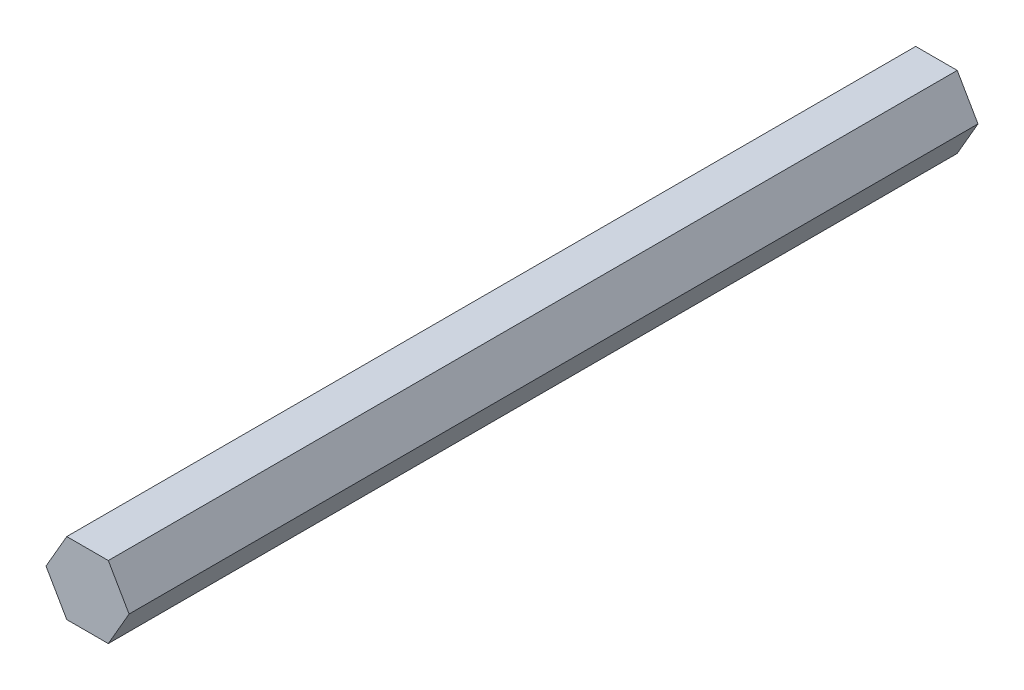
ISO-10303-21;
HEADER;
FILE_DESCRIPTION(('STEP AP214'),'2;1');
FILE_NAME('part.step','',(''),(''),'','','');
FILE_SCHEMA(('AUTOMOTIVE_DESIGN { 1 0 10303 214 1 1 1 1 }'));
ENDSEC;
DATA;
#1=APPLICATION_CONTEXT('core data for automotive mechanical design processes');
#2=APPLICATION_PROTOCOL_DEFINITION('international standard','automotive_design',2000,#1);
#3=PRODUCT_CONTEXT('',#1,'mechanical');
#4=PRODUCT('Part','Part','',(#3));
#5=PRODUCT_RELATED_PRODUCT_CATEGORY('part','',(#4));
#6=PRODUCT_DEFINITION_FORMATION('','',#4);
#7=PRODUCT_DEFINITION_CONTEXT('part definition',#1,'design');
#8=PRODUCT_DEFINITION('design','',#6,#7);
#9=PRODUCT_DEFINITION_SHAPE('','',#8);
#10=(LENGTH_UNIT() NAMED_UNIT(*) SI_UNIT(.MILLI.,.METRE.));
#11=(NAMED_UNIT(*) PLANE_ANGLE_UNIT() SI_UNIT($,.RADIAN.));
#12=(NAMED_UNIT(*) SI_UNIT($,.STERADIAN.) SOLID_ANGLE_UNIT());
#13=UNCERTAINTY_MEASURE_WITH_UNIT(LENGTH_MEASURE(1.E-05),#10,'distance_accuracy_value','');
#14=(GEOMETRIC_REPRESENTATION_CONTEXT(3) GLOBAL_UNCERTAINTY_ASSIGNED_CONTEXT((#13)) GLOBAL_UNIT_ASSIGNED_CONTEXT((#10,
#11,#12)) REPRESENTATION_CONTEXT('',''));
#15=CARTESIAN_POINT('',(0.,0.,0.));
#16=DIRECTION('',(0.,0.,1.));
#17=DIRECTION('',(1.,0.,0.));
#18=AXIS2_PLACEMENT_3D('',#15,#16,#17);
#19=CARTESIAN_POINT('',(3.66617420935418,-6.34999999999993,149.86));
#20=DIRECTION('',(-0.866025403784442,0.499999999999995,0.));
#21=DIRECTION('',(-0.499999999999995,-0.866025403784442,0.));
#22=AXIS2_PLACEMENT_3D('',#19,#20,#21);
#23=PLANE('',#22);
#24=DIRECTION('',(0.499999999999995,0.866025403784441,0.));
#25=VECTOR('',#24,1.);
#26=CARTESIAN_POINT('',(3.66617420935418,-6.34999999999993,0.));
#27=LINE('',#26,#25);
#28=CARTESIAN_POINT('',(3.66617420935418,-6.34999999999993,0.));
#29=VERTEX_POINT('',#28);
#30=CARTESIAN_POINT('',(7.33234841870822,0.,0.));
#31=VERTEX_POINT('',#30);
#32=EDGE_CURVE('E118',#29,#31,#27,.T.);
#33=ORIENTED_EDGE('',*,*,#32,.T.);
#34=DIRECTION('',(0.,0.,-1.));
#35=VECTOR('',#34,1.);
#36=CARTESIAN_POINT('',(7.33234841870822,0.,149.86));
#37=LINE('',#36,#35);
#38=CARTESIAN_POINT('',(7.33234841870822,0.,149.86));
#39=VERTEX_POINT('',#38);
#40=EDGE_CURVE('E11',#39,#31,#37,.T.);
#41=ORIENTED_EDGE('',*,*,#40,.F.);
#42=DIRECTION('',(0.499999999999995,0.866025403784441,0.));
#43=VECTOR('',#42,1.);
#44=CARTESIAN_POINT('',(3.66617420935418,-6.34999999999993,149.86));
#45=LINE('',#44,#43);
#46=CARTESIAN_POINT('',(3.66617420935418,-6.34999999999993,149.86));
#47=VERTEX_POINT('',#46);
#48=EDGE_CURVE('E129',#47,#39,#45,.T.);
#49=ORIENTED_EDGE('',*,*,#48,.F.);
#50=DIRECTION('',(0.,0.,-1.));
#51=VECTOR('',#50,1.);
#52=CARTESIAN_POINT('',(3.66617420935418,-6.34999999999993,149.86));
#53=LINE('',#52,#51);
#54=EDGE_CURVE('E114',#47,#29,#53,.T.);
#55=ORIENTED_EDGE('',*,*,#54,.T.);
#56=EDGE_LOOP('',(#33,#41,#49,#55));
#57=FACE_BOUND('',#56,.T.);
#58=ADVANCED_FACE('F34',(#57),#23,.F.);
#59=CARTESIAN_POINT('',(7.33234841870822,0.,149.86));
#60=DIRECTION('',(-0.866025403784438,-0.500000000000001,0.));
#61=DIRECTION('',(0.500000000000001,-0.866025403784438,0.));
#62=AXIS2_PLACEMENT_3D('',#59,#60,#61);
#63=PLANE('',#62);
#64=DIRECTION('',(-0.500000000000001,0.866025403784438,0.));
#65=VECTOR('',#64,1.);
#66=CARTESIAN_POINT('',(7.33234841870822,0.,0.));
#67=LINE('',#66,#65);
#68=CARTESIAN_POINT('',(3.6661742093541,6.34999999999999,0.));
#69=VERTEX_POINT('',#68);
#70=EDGE_CURVE('E121',#31,#69,#67,.T.);
#71=ORIENTED_EDGE('',*,*,#70,.T.);
#72=DIRECTION('',(0.,0.,-1.));
#73=VECTOR('',#72,1.);
#74=CARTESIAN_POINT('',(3.6661742093541,6.34999999999999,149.86));
#75=LINE('',#74,#73);
#76=CARTESIAN_POINT('',(3.6661742093541,6.34999999999999,149.86));
#77=VERTEX_POINT('',#76);
#78=EDGE_CURVE('E42',#77,#69,#75,.T.);
#79=ORIENTED_EDGE('',*,*,#78,.F.);
#80=DIRECTION('',(-0.500000000000001,0.866025403784438,0.));
#81=VECTOR('',#80,1.);
#82=CARTESIAN_POINT('',(7.33234841870822,0.,149.86));
#83=LINE('',#82,#81);
#84=EDGE_CURVE('E87',#39,#77,#83,.T.);
#85=ORIENTED_EDGE('',*,*,#84,.F.);
#86=ORIENTED_EDGE('',*,*,#40,.T.);
#87=EDGE_LOOP('',(#71,#79,#85,#86));
#88=FACE_BOUND('',#87,.T.);
#89=ADVANCED_FACE('F153',(#88),#63,.F.);
#90=CARTESIAN_POINT('',(3.6661742093541,6.34999999999999,149.86));
#91=DIRECTION('',(0.,-1.,0.));
#92=DIRECTION('',(1.,0.,0.));
#93=AXIS2_PLACEMENT_3D('',#90,#91,#92);
#94=PLANE('',#93);
#95=DIRECTION('',(-1.,0.,0.));
#96=VECTOR('',#95,1.);
#97=CARTESIAN_POINT('',(3.6661742093541,6.34999999999999,0.));
#98=LINE('',#97,#96);
#99=CARTESIAN_POINT('',(-3.66617420935414,6.34999999999996,0.));
#100=VERTEX_POINT('',#99);
#101=EDGE_CURVE('E124',#69,#100,#98,.T.);
#102=ORIENTED_EDGE('',*,*,#101,.T.);
#103=DIRECTION('',(0.,0.,-1.));
#104=VECTOR('',#103,1.);
#105=CARTESIAN_POINT('',(-3.66617420935414,6.34999999999996,149.86));
#106=LINE('',#105,#104);
#107=CARTESIAN_POINT('',(-3.66617420935414,6.34999999999996,149.86));
#108=VERTEX_POINT('',#107);
#109=EDGE_CURVE('E109',#108,#100,#106,.T.);
#110=ORIENTED_EDGE('',*,*,#109,.F.);
#111=DIRECTION('',(-1.,0.,0.));
#112=VECTOR('',#111,1.);
#113=CARTESIAN_POINT('',(3.6661742093541,6.34999999999999,149.86));
#114=LINE('',#113,#112);
#115=EDGE_CURVE('E100',#77,#108,#114,.T.);
#116=ORIENTED_EDGE('',*,*,#115,.F.);
#117=ORIENTED_EDGE('',*,*,#78,.T.);
#118=EDGE_LOOP('',(#102,#110,#116,#117));
#119=FACE_BOUND('',#118,.T.);
#120=ADVANCED_FACE('F135',(#119),#94,.F.);
#121=CARTESIAN_POINT('',(-3.66617420935414,6.34999999999996,149.86));
#122=DIRECTION('',(0.866025403784442,-0.499999999999995,0.));
#123=DIRECTION('',(0.499999999999995,0.866025403784442,0.));
#124=AXIS2_PLACEMENT_3D('',#121,#122,#123);
#125=PLANE('',#124);
#126=DIRECTION('',(-0.499999999999995,-0.866025403784441,0.));
#127=VECTOR('',#126,1.);
#128=CARTESIAN_POINT('',(-3.66617420935414,6.34999999999996,0.));
#129=LINE('',#128,#127);
#130=CARTESIAN_POINT('',(-7.33234841870822,0.,0.));
#131=VERTEX_POINT('',#130);
#132=EDGE_CURVE('E108',#100,#131,#129,.T.);
#133=ORIENTED_EDGE('',*,*,#132,.T.);
#134=DIRECTION('',(0.,0.,-1.));
#135=VECTOR('',#134,1.);
#136=CARTESIAN_POINT('',(-7.33234841870822,0.,149.86));
#137=LINE('',#136,#135);
#138=CARTESIAN_POINT('',(-7.33234841870822,0.,149.86));
#139=VERTEX_POINT('',#138);
#140=EDGE_CURVE('E105',#139,#131,#137,.T.);
#141=ORIENTED_EDGE('',*,*,#140,.F.);
#142=DIRECTION('',(-0.499999999999995,-0.866025403784441,0.));
#143=VECTOR('',#142,1.);
#144=CARTESIAN_POINT('',(-3.66617420935414,6.34999999999996,149.86));
#145=LINE('',#144,#143);
#146=EDGE_CURVE('E94',#108,#139,#145,.T.);
#147=ORIENTED_EDGE('',*,*,#146,.F.);
#148=ORIENTED_EDGE('',*,*,#109,.T.);
#149=EDGE_LOOP('',(#133,#141,#147,#148));
#150=FACE_BOUND('',#149,.T.);
#151=ADVANCED_FACE('F106',(#150),#125,.F.);
#152=CARTESIAN_POINT('',(-7.33234841870822,0.,149.86));
#153=DIRECTION('',(0.866025403784435,0.500000000000007,0.));
#154=DIRECTION('',(-0.500000000000007,0.866025403784435,0.));
#155=AXIS2_PLACEMENT_3D('',#152,#153,#154);
#156=PLANE('',#155);
#157=DIRECTION('',(0.500000000000007,-0.866025403784434,0.));
#158=VECTOR('',#157,1.);
#159=CARTESIAN_POINT('',(-7.33234841870822,0.,0.));
#160=LINE('',#159,#158);
#161=CARTESIAN_POINT('',(-3.66617420935405,-6.35000000000001,0.));
#162=VERTEX_POINT('',#161);
#163=EDGE_CURVE('E73',#131,#162,#160,.T.);
#164=ORIENTED_EDGE('',*,*,#163,.T.);
#165=DIRECTION('',(0.,0.,-1.));
#166=VECTOR('',#165,1.);
#167=CARTESIAN_POINT('',(-3.66617420935405,-6.35000000000001,149.86));
#168=LINE('',#167,#166);
#169=CARTESIAN_POINT('',(-3.66617420935405,-6.35000000000001,149.86));
#170=VERTEX_POINT('',#169);
#171=EDGE_CURVE('E110',#170,#162,#168,.T.);
#172=ORIENTED_EDGE('',*,*,#171,.F.);
#173=DIRECTION('',(0.500000000000007,-0.866025403784434,0.));
#174=VECTOR('',#173,1.);
#175=CARTESIAN_POINT('',(-7.33234841870822,0.,149.86));
#176=LINE('',#175,#174);
#177=EDGE_CURVE('E98',#139,#170,#176,.T.);
#178=ORIENTED_EDGE('',*,*,#177,.F.);
#179=ORIENTED_EDGE('',*,*,#140,.T.);
#180=EDGE_LOOP('',(#164,#172,#178,#179));
#181=FACE_BOUND('',#180,.T.);
#182=ADVANCED_FACE('F112',(#181),#156,.F.);
#183=CARTESIAN_POINT('',(-3.66617420935405,-6.35000000000001,149.86));
#184=DIRECTION('',(0.,1.,0.));
#185=DIRECTION('',(-1.,0.,0.));
#186=AXIS2_PLACEMENT_3D('',#183,#184,#185);
#187=PLANE('',#186);
#188=DIRECTION('',(1.,0.,0.));
#189=VECTOR('',#188,1.);
#190=CARTESIAN_POINT('',(-3.66617420935405,-6.35000000000001,0.));
#191=LINE('',#190,#189);
#192=EDGE_CURVE('E79',#162,#29,#191,.T.);
#193=ORIENTED_EDGE('',*,*,#192,.T.);
#194=ORIENTED_EDGE('',*,*,#54,.F.);
#195=DIRECTION('',(1.,0.,0.));
#196=VECTOR('',#195,1.);
#197=CARTESIAN_POINT('',(-3.66617420935405,-6.35000000000001,149.86));
#198=LINE('',#197,#196);
#199=EDGE_CURVE('E50',#170,#47,#198,.T.);
#200=ORIENTED_EDGE('',*,*,#199,.F.);
#201=ORIENTED_EDGE('',*,*,#171,.T.);
#202=EDGE_LOOP('',(#193,#194,#200,#201));
#203=FACE_BOUND('',#202,.T.);
#204=ADVANCED_FACE('F142',(#203),#187,.F.);
#205=CARTESIAN_POINT('',(0.,0.,149.86));
#206=DIRECTION('',(0.,0.,1.));
#207=DIRECTION('',(1.,0.,0.));
#208=AXIS2_PLACEMENT_3D('',#205,#206,#207);
#209=PLANE('',#208);
#210=ORIENTED_EDGE('',*,*,#48,.T.);
#211=ORIENTED_EDGE('',*,*,#84,.T.);
#212=ORIENTED_EDGE('',*,*,#115,.T.);
#213=ORIENTED_EDGE('',*,*,#146,.T.);
#214=ORIENTED_EDGE('',*,*,#177,.T.);
#215=ORIENTED_EDGE('',*,*,#199,.T.);
#216=EDGE_LOOP('',(#210,#211,#212,#213,#214,#215));
#217=FACE_BOUND('',#216,.T.);
#218=ADVANCED_FACE('F96',(#217),#209,.T.);
#219=CARTESIAN_POINT('',(0.,0.,0.));
#220=DIRECTION('',(0.,0.,1.));
#221=DIRECTION('',(1.,0.,0.));
#222=AXIS2_PLACEMENT_3D('',#219,#220,#221);
#223=PLANE('',#222);
#224=CARTESIAN_POINT('',(0.,0.,0.));
#225=DIRECTION('',(0.,0.,-1.));
#226=DIRECTION('',(-1.,0.,0.));
#227=AXIS2_PLACEMENT_3D('',#224,#225,#226);
#228=CIRCLE('',#227,2.54);
#229=CARTESIAN_POINT('',(-2.54,0.,0.));
#230=VERTEX_POINT('',#229);
#231=EDGE_CURVE('E215',#230,#230,#228,.T.);
#232=ORIENTED_EDGE('',*,*,#231,.F.);
#233=EDGE_LOOP('',(#232));
#234=FACE_BOUND('',#233,.T.);
#235=ORIENTED_EDGE('',*,*,#32,.F.);
#236=ORIENTED_EDGE('',*,*,#192,.F.);
#237=ORIENTED_EDGE('',*,*,#163,.F.);
#238=ORIENTED_EDGE('',*,*,#132,.F.);
#239=ORIENTED_EDGE('',*,*,#101,.F.);
#240=ORIENTED_EDGE('',*,*,#70,.F.);
#241=EDGE_LOOP('',(#235,#236,#237,#238,#239,#240));
#242=FACE_BOUND('',#241,.T.);
#243=ADVANCED_FACE('F138',(#234,#242),#223,.F.);
#244=CARTESIAN_POINT('',(0.,0.,20.574));
#245=DIRECTION('',(0.,0.,-1.));
#246=DIRECTION('',(-1.,0.,0.));
#247=AXIS2_PLACEMENT_3D('',#244,#245,#246);
#248=CYLINDRICAL_SURFACE('',#247,2.54);
#249=CARTESIAN_POINT('',(0.,0.,20.574));
#250=DIRECTION('',(0.,0.,-1.));
#251=DIRECTION('',(-1.,0.,0.));
#252=AXIS2_PLACEMENT_3D('',#249,#250,#251);
#253=CIRCLE('',#252,2.54);
#254=CARTESIAN_POINT('',(-2.54,0.,20.574));
#255=VERTEX_POINT('',#254);
#256=EDGE_CURVE('E122',#255,#255,#253,.T.);
#257=ORIENTED_EDGE('',*,*,#256,.F.);
#258=EDGE_LOOP('',(#257));
#259=FACE_BOUND('',#258,.T.);
#260=ORIENTED_EDGE('',*,*,#231,.T.);
#261=EDGE_LOOP('',(#260));
#262=FACE_BOUND('',#261,.T.);
#263=ADVANCED_FACE('F190',(#259,#262),#248,.F.);
#264=CARTESIAN_POINT('',(0.,0.,20.574));
#265=DIRECTION('',(0.,0.,-1.));
#266=DIRECTION('',(-1.,0.,0.));
#267=AXIS2_PLACEMENT_3D('',#264,#265,#266);
#268=PLANE('',#267);
#269=ORIENTED_EDGE('',*,*,#256,.T.);
#270=EDGE_LOOP('',(#269));
#271=FACE_BOUND('',#270,.T.);
#272=ADVANCED_FACE('F199',(#271),#268,.T.);
#273=CLOSED_SHELL('',(#58,#89,#120,#151,#182,#204,#218,#243,#263,#272));
#274=MANIFOLD_SOLID_BREP('B2',#273);
#275=ADVANCED_BREP_SHAPE_REPRESENTATION('',(#18,#274),#14);
#276=SHAPE_DEFINITION_REPRESENTATION(#9,#275);
ENDSEC;
END-ISO-10303-21;
